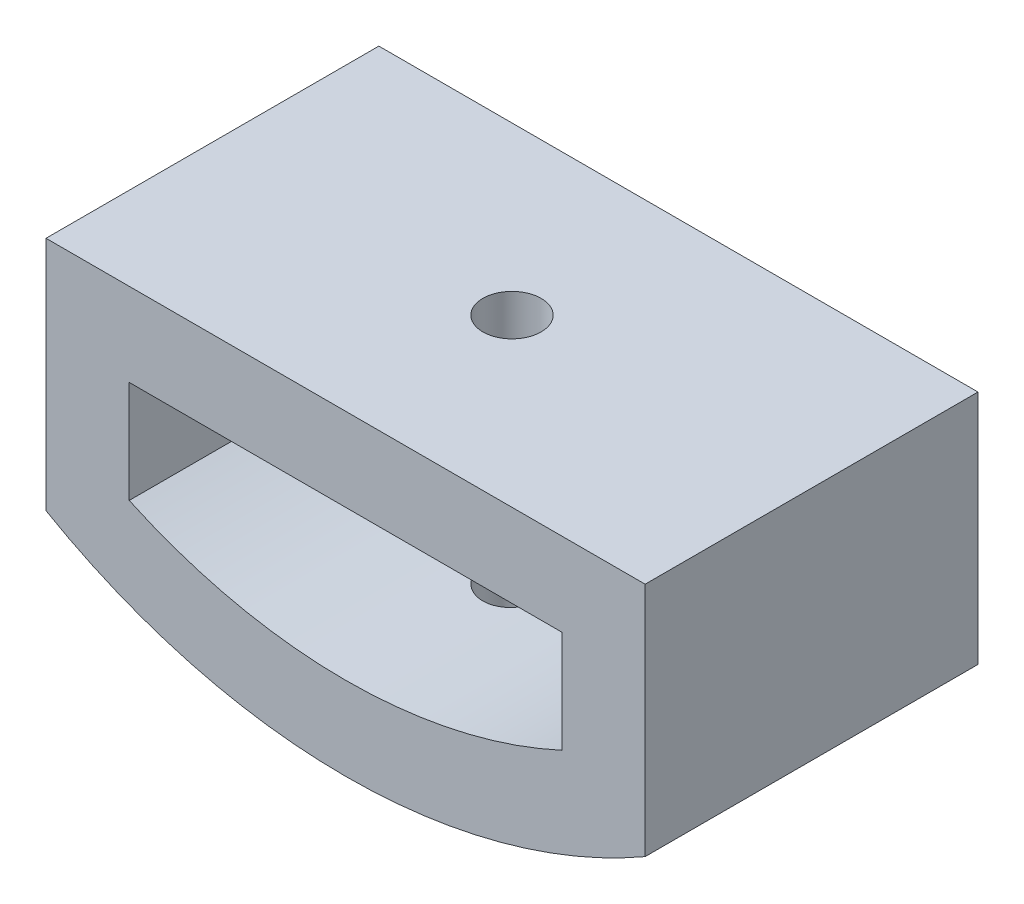
ISO-10303-21;
HEADER;
FILE_DESCRIPTION(('STEP AP214'),'2;1');
FILE_NAME('part.step','',(''),(''),'','','');
FILE_SCHEMA(('AUTOMOTIVE_DESIGN { 1 0 10303 214 1 1 1 1 }'));
ENDSEC;
DATA;
#1=APPLICATION_CONTEXT('core data for automotive mechanical design processes');
#2=APPLICATION_PROTOCOL_DEFINITION('international standard','automotive_design',2000,#1);
#3=PRODUCT_CONTEXT('',#1,'mechanical');
#4=PRODUCT('Part','Part','',(#3));
#5=PRODUCT_RELATED_PRODUCT_CATEGORY('part','',(#4));
#6=PRODUCT_DEFINITION_FORMATION('','',#4);
#7=PRODUCT_DEFINITION_CONTEXT('part definition',#1,'design');
#8=PRODUCT_DEFINITION('design','',#6,#7);
#9=PRODUCT_DEFINITION_SHAPE('','',#8);
#10=(LENGTH_UNIT() NAMED_UNIT(*) SI_UNIT(.MILLI.,.METRE.));
#11=(NAMED_UNIT(*) PLANE_ANGLE_UNIT() SI_UNIT($,.RADIAN.));
#12=(NAMED_UNIT(*) SI_UNIT($,.STERADIAN.) SOLID_ANGLE_UNIT());
#13=UNCERTAINTY_MEASURE_WITH_UNIT(LENGTH_MEASURE(1.E-05),#10,'distance_accuracy_value','');
#14=(GEOMETRIC_REPRESENTATION_CONTEXT(3) GLOBAL_UNCERTAINTY_ASSIGNED_CONTEXT((#13)) GLOBAL_UNIT_ASSIGNED_CONTEXT((#10,
#11,#12)) REPRESENTATION_CONTEXT('',''));
#15=CARTESIAN_POINT('',(0.,0.,0.));
#16=DIRECTION('',(0.,0.,1.));
#17=DIRECTION('',(1.,0.,0.));
#18=AXIS2_PLACEMENT_3D('',#15,#16,#17);
#19=CARTESIAN_POINT('',(0.,0.,10.));
#20=DIRECTION('',(0.,0.,-1.));
#21=DIRECTION('',(-1.,0.,0.));
#22=AXIS2_PLACEMENT_3D('',#19,#20,#21);
#23=CYLINDRICAL_SURFACE('',#22,15.5);
#24=CARTESIAN_POINT('',(0.,-15.5,5.875));
#25=CARTESIAN_POINT('',(0.0491071731834431,-15.4999996705944,5.87499783588226));
#26=CARTESIAN_POINT('',(0.09824895647254,-15.4997641299861,5.87085208723008));
#27=CARTESIAN_POINT('',(0.195176255878906,-15.4988471560204,5.85437301521202));
#28=CARTESIAN_POINT('',(0.242960115048824,-15.4981652004298,5.84203010224855));
#29=CARTESIAN_POINT('',(0.335753495446608,-15.4964325636527,5.80951177089862));
#30=CARTESIAN_POINT('',(0.380764440814087,-15.4953820736292,5.78934041264184));
#31=CARTESIAN_POINT('',(0.466749535573831,-15.4930306004436,5.74174418977581));
#32=CARTESIAN_POINT('',(0.507724620959285,-15.4917296755699,5.71432101246433));
#33=CARTESIAN_POINT('',(0.584538004698171,-15.4890218060226,5.65296182557492));
#34=CARTESIAN_POINT('',(0.620370618132307,-15.4876147465997,5.61901870373717));
#35=CARTESIAN_POINT('',(0.685833359404959,-15.4848541761742,5.54559761465866));
#36=CARTESIAN_POINT('',(0.71546323106227,-15.4835006673851,5.50611941892462));
#37=CARTESIAN_POINT('',(0.767696144330844,-15.4809989777071,5.42271763252899));
#38=CARTESIAN_POINT('',(0.790294583211297,-15.4798509315207,5.37879115487809));
#39=CARTESIAN_POINT('',(0.827793661333704,-15.4778910797385,5.2877599930964));
#40=CARTESIAN_POINT('',(0.842694370873767,-15.4770792710722,5.24065533799418));
#41=CARTESIAN_POINT('',(0.864359555364982,-15.4758845109363,5.14465868423292));
#42=CARTESIAN_POINT('',(0.871132768735348,-15.4755010988993,5.09576866354446));
#43=CARTESIAN_POINT('',(0.876377662953798,-15.4752049882841,4.99754420340506));
#44=CARTESIAN_POINT('',(0.874849423229832,-15.4752922852023,4.94820976821077));
#45=CARTESIAN_POINT('',(0.863542056230346,-15.4759273202646,4.85055636976696));
#46=CARTESIAN_POINT('',(0.853772377225552,-15.4764745311448,4.80223630858999));
#47=CARTESIAN_POINT('',(0.826274105440732,-15.4779668920098,4.70792308868196));
#48=CARTESIAN_POINT('',(0.808545472152446,-15.47891204402,4.66192994179538));
#49=CARTESIAN_POINT('',(0.765621783398995,-15.48109437473,4.57354572741357));
#50=CARTESIAN_POINT('',(0.740422430880505,-15.4823317214126,4.53115675109275));
#51=CARTESIAN_POINT('',(0.683275742305958,-15.4849588206083,4.45120701150883));
#52=CARTESIAN_POINT('',(0.651328344827962,-15.4863485745087,4.41364629219841));
#53=CARTESIAN_POINT('',(0.581539168419842,-15.48912620295,4.34436429584336));
#54=CARTESIAN_POINT('',(0.543689210117857,-15.4905140721459,4.31265125724773));
#55=CARTESIAN_POINT('',(0.463198043771124,-15.4931296460988,4.25602835305752));
#56=CARTESIAN_POINT('',(0.420556834322565,-15.4943573508088,4.23111848945624));
#57=CARTESIAN_POINT('',(0.33168868630968,-15.4965143161274,4.18880977904227));
#58=CARTESIAN_POINT('',(0.285461604861852,-15.4974435648362,4.17141123170881));
#59=CARTESIAN_POINT('',(0.190736113107066,-15.4988987312108,4.14462447727959));
#60=CARTESIAN_POINT('',(0.14223772445757,-15.4994246527216,4.13523619382044));
#61=CARTESIAN_POINT('',(0.0444178096076593,-15.5000134021482,4.12474664645022));
#62=CARTESIAN_POINT('',(-0.00490249123173848,-15.5000768667183,4.12363398962057));
#63=CARTESIAN_POINT('',(-0.103029064809225,-15.4997352420546,4.12969753032642));
#64=CARTESIAN_POINT('',(-0.151835339722116,-15.4993301548039,4.13687369277837));
#65=CARTESIAN_POINT('',(-0.24751642329515,-15.4980974508633,4.15930173575539));
#66=CARTESIAN_POINT('',(-0.294392458008775,-15.4972701070007,4.17454840202342));
#67=CARTESIAN_POINT('',(-0.384920227564263,-15.4952860037139,4.21267936507442));
#68=CARTESIAN_POINT('',(-0.428571938723266,-15.4941292418703,4.23556371794987));
#69=CARTESIAN_POINT('',(-0.511464193756999,-15.4916147717464,4.28834953917195));
#70=CARTESIAN_POINT('',(-0.55069987633316,-15.4902568457532,4.31825863093923));
#71=CARTESIAN_POINT('',(-0.62359740977994,-15.4874936517481,4.38423380306049));
#72=CARTESIAN_POINT('',(-0.657259215573696,-15.4860883833534,4.42029993320267));
#73=CARTESIAN_POINT('',(-0.718091933006208,-15.4833870598261,4.49761447817488));
#74=CARTESIAN_POINT('',(-0.745255463653431,-15.4820911299553,4.5388687054957));
#75=CARTESIAN_POINT('',(-0.792270092164751,-15.4797566050878,4.62535909754729));
#76=CARTESIAN_POINT('',(-0.812121228359953,-15.4787180087423,4.67059524140357));
#77=CARTESIAN_POINT('',(-0.843934739917809,-15.4770161713392,4.76373822183959));
#78=CARTESIAN_POINT('',(-0.855901791389932,-15.4763527078207,4.81164345704037));
#79=CARTESIAN_POINT('',(-0.871622715891765,-15.4754753331965,4.90878709408894));
#80=CARTESIAN_POINT('',(-0.875376652558362,-15.4752614186075,4.95802548560418));
#81=CARTESIAN_POINT('',(-0.874564185969052,-15.4753073493798,5.05636431234336));
#82=CARTESIAN_POINT('',(-0.870009390048366,-15.47556653382,5.10546484419769));
#83=CARTESIAN_POINT('',(-0.852732781730422,-15.4765280546384,5.20220284922323));
#84=CARTESIAN_POINT('',(-0.840010954117671,-15.4772303918423,5.24984031966852));
#85=CARTESIAN_POINT('',(-0.806763910415406,-15.4789989093103,5.34230201587434));
#86=CARTESIAN_POINT('',(-0.786238686650659,-15.4800650899322,5.38712623886776));
#87=CARTESIAN_POINT('',(-0.737969250321252,-15.4824411098091,5.47269360556119));
#88=CARTESIAN_POINT('',(-0.710225242369575,-15.4837509421576,5.51343686488883));
#89=CARTESIAN_POINT('',(-0.648263407453841,-15.4864687629549,5.58974425921163));
#90=CARTESIAN_POINT('',(-0.614037310019295,-15.4878768753334,5.6253016738811));
#91=CARTESIAN_POINT('',(-0.540091698196106,-15.4906315818375,5.6901777947369));
#92=CARTESIAN_POINT('',(-0.500370838072219,-15.491978160785,5.71949496813201));
#93=CARTESIAN_POINT('',(-0.416525226113139,-15.4944592208667,5.77107593345151));
#94=CARTESIAN_POINT('',(-0.372395705371244,-15.4955934684246,5.79333197621583));
#95=CARTESIAN_POINT('',(-0.281052471728243,-15.4975187583378,5.83009202550559));
#96=CARTESIAN_POINT('',(-0.233842460517063,-15.4983102041917,5.84460515061119));
#97=CARTESIAN_POINT('',(-0.155284423661831,-15.4992523199624,5.86167752144685));
#98=CARTESIAN_POINT('',(-0.124444733863215,-15.4995314610104,5.86666703272838));
#99=CARTESIAN_POINT('',(-0.062408022674479,-15.4999054056072,5.87332895789179));
#100=CARTESIAN_POINT('',(-0.0312110016800361,-15.50000020936,5.87500137544636));
#101=CARTESIAN_POINT('',(0.,-15.5,5.875));
#102=B_SPLINE_CURVE_WITH_KNOTS('',3,(#24,#25,#26,#27,#28,#29,#30,#31,#32,#33,#34,#35,#36,#37,
#38,#39,#40,#41,#42,#43,#44,#45,#46,#47,#48,#49,#50,#51,#52,#53,#54,#55,#56,#57,#58,#59,#60,#61,
#62,#63,#64,#65,#66,#67,#68,#69,#70,#71,#72,#73,#74,#75,#76,#77,#78,#79,#80,#81,#82,#83,#84,#85,
#86,#87,#88,#89,#90,#91,#92,#93,#94,#95,#96,#97,#98,#99,#100,#101),.UNSPECIFIED.,.T.,.F.,(4,2,2,
2,2,2,2,2,2,2,2,2,2,2,2,2,2,2,2,2,2,2,2,2,2,2,2,2,2,2,2,2,2,2,2,2,2,2,4),(0.,0.147207584406241,
0.2945876862831,0.441891453157804,0.589160976629402,0.736592070381813,0.88402925202701,
1.03156274304558,1.17909488671762,1.32646826609707,1.4738402354168,1.62104348166905,
1.76824747714221,1.915536307114,2.06282647779344,2.21032259729529,2.35781876001285,
2.50532080291927,2.65282143964427,2.80011897702594,2.94741589095309,3.09461775403723,
3.24182069822089,3.38918413489114,3.5365487632557,3.68407998766663,3.83161043871729,
3.97905330939336,4.12649503764796,4.27373094689464,4.42096713044826,4.56820345882021,
4.71543561430341,4.86285690388399,5.01031436289276,5.15793309214934,5.30537758976411,
5.39893828473857,5.49249887612211),.UNSPECIFIED.);
#103=CARTESIAN_POINT('',(0.,-15.5,5.875));
#104=VERTEX_POINT('',#103);
#105=EDGE_CURVE('E141',#104,#104,#102,.T.);
#106=ORIENTED_EDGE('',*,*,#105,.F.);
#107=EDGE_LOOP('',(#106));
#108=FACE_BOUND('',#107,.T.);
#109=CARTESIAN_POINT('',(0.,0.,0.));
#110=DIRECTION('',(0.,0.,1.));
#111=DIRECTION('',(1.,0.,0.));
#112=AXIS2_PLACEMENT_3D('',#109,#110,#111);
#113=CIRCLE('',#112,15.5);
#114=CARTESIAN_POINT('',(-6.5,-14.0712472794703,0.));
#115=VERTEX_POINT('',#114);
#116=CARTESIAN_POINT('',(6.5,-14.0712472794703,0.));
#117=VERTEX_POINT('',#116);
#118=EDGE_CURVE('E148',#115,#117,#113,.T.);
#119=ORIENTED_EDGE('',*,*,#118,.F.);
#120=DIRECTION('',(0.,0.,-1.));
#121=VECTOR('',#120,1.);
#122=CARTESIAN_POINT('',(-6.5,-14.0712472794703,10.));
#123=LINE('',#122,#121);
#124=CARTESIAN_POINT('',(-6.5,-14.0712472794703,10.));
#125=VERTEX_POINT('',#124);
#126=EDGE_CURVE('E11',#125,#115,#123,.T.);
#127=ORIENTED_EDGE('',*,*,#126,.F.);
#128=CARTESIAN_POINT('',(0.,0.,10.));
#129=DIRECTION('',(0.,0.,1.));
#130=DIRECTION('',(1.,0.,0.));
#131=AXIS2_PLACEMENT_3D('',#128,#129,#130);
#132=CIRCLE('',#131,15.5);
#133=CARTESIAN_POINT('',(6.5,-14.0712472794703,10.));
#134=VERTEX_POINT('',#133);
#135=EDGE_CURVE('E129',#125,#134,#132,.T.);
#136=ORIENTED_EDGE('',*,*,#135,.T.);
#137=DIRECTION('',(0.,0.,-1.));
#138=VECTOR('',#137,1.);
#139=CARTESIAN_POINT('',(6.5,-14.0712472794703,10.));
#140=LINE('',#139,#138);
#141=EDGE_CURVE('E93',#134,#117,#140,.T.);
#142=ORIENTED_EDGE('',*,*,#141,.T.);
#143=EDGE_LOOP('',(#119,#127,#136,#142));
#144=FACE_BOUND('',#143,.T.);
#145=ADVANCED_FACE('F35',(#108,#144),#23,.F.);
#146=CARTESIAN_POINT('',(-6.5,0.,10.));
#147=DIRECTION('',(1.,0.,0.));
#148=DIRECTION('',(0.,0.,-1.));
#149=AXIS2_PLACEMENT_3D('',#146,#147,#148);
#150=PLANE('',#149);
#151=DIRECTION('',(0.,-1.,0.));
#152=VECTOR('',#151,1.);
#153=CARTESIAN_POINT('',(-6.5,0.,0.));
#154=LINE('',#153,#152);
#155=CARTESIAN_POINT('',(-6.5,-11.,0.));
#156=VERTEX_POINT('',#155);
#157=EDGE_CURVE('E121',#156,#115,#154,.T.);
#158=ORIENTED_EDGE('',*,*,#157,.F.);
#159=DIRECTION('',(0.,0.,-1.));
#160=VECTOR('',#159,1.);
#161=CARTESIAN_POINT('',(-6.5,-11.,10.));
#162=LINE('',#161,#160);
#163=CARTESIAN_POINT('',(-6.5,-11.,10.));
#164=VERTEX_POINT('',#163);
#165=EDGE_CURVE('E50',#164,#156,#162,.T.);
#166=ORIENTED_EDGE('',*,*,#165,.F.);
#167=DIRECTION('',(0.,-1.,0.));
#168=VECTOR('',#167,1.);
#169=CARTESIAN_POINT('',(-6.5,0.,10.));
#170=LINE('',#169,#168);
#171=EDGE_CURVE('E119',#164,#125,#170,.T.);
#172=ORIENTED_EDGE('',*,*,#171,.T.);
#173=ORIENTED_EDGE('',*,*,#126,.T.);
#174=EDGE_LOOP('',(#158,#166,#172,#173));
#175=FACE_BOUND('',#174,.T.);
#176=ADVANCED_FACE('F118',(#175),#150,.T.);
#177=CARTESIAN_POINT('',(0.,-11.,10.));
#178=DIRECTION('',(0.,-1.,0.));
#179=DIRECTION('',(1.,0.,0.));
#180=AXIS2_PLACEMENT_3D('',#177,#178,#179);
#181=PLANE('',#180);
#182=CARTESIAN_POINT('',(0.,-11.,5.));
#183=DIRECTION('',(0.,-1.,0.));
#184=DIRECTION('',(1.,0.,0.));
#185=AXIS2_PLACEMENT_3D('',#182,#183,#184);
#186=CIRCLE('',#185,0.875);
#187=CARTESIAN_POINT('',(0.875,-11.,5.));
#188=VERTEX_POINT('',#187);
#189=EDGE_CURVE('E219',#188,#188,#186,.T.);
#190=ORIENTED_EDGE('',*,*,#189,.F.);
#191=EDGE_LOOP('',(#190));
#192=FACE_BOUND('',#191,.T.);
#193=DIRECTION('',(-1.,0.,0.));
#194=VECTOR('',#193,1.);
#195=CARTESIAN_POINT('',(0.,-11.,0.));
#196=LINE('',#195,#194);
#197=CARTESIAN_POINT('',(6.5,-11.,0.));
#198=VERTEX_POINT('',#197);
#199=EDGE_CURVE('E152',#198,#156,#196,.T.);
#200=ORIENTED_EDGE('',*,*,#199,.F.);
#201=DIRECTION('',(0.,0.,-1.));
#202=VECTOR('',#201,1.);
#203=CARTESIAN_POINT('',(6.5,-11.,10.));
#204=LINE('',#203,#202);
#205=CARTESIAN_POINT('',(6.5,-11.,10.));
#206=VERTEX_POINT('',#205);
#207=EDGE_CURVE('E86',#206,#198,#204,.T.);
#208=ORIENTED_EDGE('',*,*,#207,.F.);
#209=DIRECTION('',(-1.,0.,0.));
#210=VECTOR('',#209,1.);
#211=CARTESIAN_POINT('',(0.,-11.,10.));
#212=LINE('',#211,#210);
#213=EDGE_CURVE('E128',#206,#164,#212,.T.);
#214=ORIENTED_EDGE('',*,*,#213,.T.);
#215=ORIENTED_EDGE('',*,*,#165,.T.);
#216=EDGE_LOOP('',(#200,#208,#214,#215));
#217=FACE_BOUND('',#216,.T.);
#218=ADVANCED_FACE('F131',(#192,#217),#181,.T.);
#219=CARTESIAN_POINT('',(9.,0.,10.));
#220=DIRECTION('',(1.,0.,0.));
#221=DIRECTION('',(0.,0.,-1.));
#222=AXIS2_PLACEMENT_3D('',#219,#220,#221);
#223=PLANE('',#222);
#224=DIRECTION('',(0.,-1.,0.));
#225=VECTOR('',#224,1.);
#226=CARTESIAN_POINT('',(9.,0.,0.));
#227=LINE('',#226,#225);
#228=CARTESIAN_POINT('',(9.,-8.5,0.));
#229=VERTEX_POINT('',#228);
#230=CARTESIAN_POINT('',(9.,-15.5884572681199,0.));
#231=VERTEX_POINT('',#230);
#232=EDGE_CURVE('E137',#229,#231,#227,.T.);
#233=ORIENTED_EDGE('',*,*,#232,.F.);
#234=DIRECTION('',(0.,0.,-1.));
#235=VECTOR('',#234,1.);
#236=CARTESIAN_POINT('',(9.,-8.5,10.));
#237=LINE('',#236,#235);
#238=CARTESIAN_POINT('',(9.,-8.5,10.));
#239=VERTEX_POINT('',#238);
#240=EDGE_CURVE('E100',#239,#229,#237,.T.);
#241=ORIENTED_EDGE('',*,*,#240,.F.);
#242=DIRECTION('',(0.,-1.,0.));
#243=VECTOR('',#242,1.);
#244=CARTESIAN_POINT('',(9.,0.,10.));
#245=LINE('',#244,#243);
#246=CARTESIAN_POINT('',(9.,-15.5884572681199,10.));
#247=VERTEX_POINT('',#246);
#248=EDGE_CURVE('E156',#239,#247,#245,.T.);
#249=ORIENTED_EDGE('',*,*,#248,.T.);
#250=DIRECTION('',(0.,0.,-1.));
#251=VECTOR('',#250,1.);
#252=CARTESIAN_POINT('',(9.,-15.5884572681199,10.));
#253=LINE('',#252,#251);
#254=EDGE_CURVE('E133',#247,#231,#253,.T.);
#255=ORIENTED_EDGE('',*,*,#254,.T.);
#256=EDGE_LOOP('',(#233,#241,#249,#255));
#257=FACE_BOUND('',#256,.T.);
#258=ADVANCED_FACE('F37',(#257),#223,.T.);
#259=CARTESIAN_POINT('',(0.,-8.5,10.));
#260=DIRECTION('',(0.,-1.,0.));
#261=DIRECTION('',(1.,0.,0.));
#262=AXIS2_PLACEMENT_3D('',#259,#260,#261);
#263=PLANE('',#262);
#264=CARTESIAN_POINT('',(0.,-8.5,5.));
#265=DIRECTION('',(0.,-1.,0.));
#266=DIRECTION('',(1.,0.,0.));
#267=AXIS2_PLACEMENT_3D('',#264,#265,#266);
#268=CIRCLE('',#267,0.875);
#269=CARTESIAN_POINT('',(0.875,-8.5,5.));
#270=VERTEX_POINT('',#269);
#271=EDGE_CURVE('E322',#270,#270,#268,.T.);
#272=ORIENTED_EDGE('',*,*,#271,.T.);
#273=EDGE_LOOP('',(#272));
#274=FACE_BOUND('',#273,.T.);
#275=DIRECTION('',(-1.,0.,0.));
#276=VECTOR('',#275,1.);
#277=CARTESIAN_POINT('',(0.,-8.5,0.));
#278=LINE('',#277,#276);
#279=CARTESIAN_POINT('',(-9.,-8.5,0.));
#280=VERTEX_POINT('',#279);
#281=EDGE_CURVE('E140',#229,#280,#278,.T.);
#282=ORIENTED_EDGE('',*,*,#281,.T.);
#283=DIRECTION('',(0.,0.,-1.));
#284=VECTOR('',#283,1.);
#285=CARTESIAN_POINT('',(-9.,-8.5,10.));
#286=LINE('',#285,#284);
#287=CARTESIAN_POINT('',(-9.,-8.5,10.));
#288=VERTEX_POINT('',#287);
#289=EDGE_CURVE('E163',#288,#280,#286,.T.);
#290=ORIENTED_EDGE('',*,*,#289,.F.);
#291=DIRECTION('',(-1.,0.,0.));
#292=VECTOR('',#291,1.);
#293=CARTESIAN_POINT('',(0.,-8.5,10.));
#294=LINE('',#293,#292);
#295=EDGE_CURVE('E169',#239,#288,#294,.T.);
#296=ORIENTED_EDGE('',*,*,#295,.F.);
#297=ORIENTED_EDGE('',*,*,#240,.T.);
#298=EDGE_LOOP('',(#282,#290,#296,#297));
#299=FACE_BOUND('',#298,.T.);
#300=ADVANCED_FACE('F167',(#274,#299),#263,.F.);
#301=CARTESIAN_POINT('',(-9.,0.,10.));
#302=DIRECTION('',(1.,0.,0.));
#303=DIRECTION('',(0.,0.,-1.));
#304=AXIS2_PLACEMENT_3D('',#301,#302,#303);
#305=PLANE('',#304);
#306=DIRECTION('',(0.,-1.,0.));
#307=VECTOR('',#306,1.);
#308=CARTESIAN_POINT('',(-9.,0.,0.));
#309=LINE('',#308,#307);
#310=CARTESIAN_POINT('',(-9.,-15.5884572681199,0.));
#311=VERTEX_POINT('',#310);
#312=EDGE_CURVE('E143',#280,#311,#309,.T.);
#313=ORIENTED_EDGE('',*,*,#312,.T.);
#314=DIRECTION('',(0.,0.,-1.));
#315=VECTOR('',#314,1.);
#316=CARTESIAN_POINT('',(-9.,-15.5884572681199,10.));
#317=LINE('',#316,#315);
#318=CARTESIAN_POINT('',(-9.,-15.5884572681199,10.));
#319=VERTEX_POINT('',#318);
#320=EDGE_CURVE('E160',#319,#311,#317,.T.);
#321=ORIENTED_EDGE('',*,*,#320,.F.);
#322=DIRECTION('',(0.,-1.,0.));
#323=VECTOR('',#322,1.);
#324=CARTESIAN_POINT('',(-9.,0.,10.));
#325=LINE('',#324,#323);
#326=EDGE_CURVE('E185',#288,#319,#325,.T.);
#327=ORIENTED_EDGE('',*,*,#326,.F.);
#328=ORIENTED_EDGE('',*,*,#289,.T.);
#329=EDGE_LOOP('',(#313,#321,#327,#328));
#330=FACE_BOUND('',#329,.T.);
#331=ADVANCED_FACE('F184',(#330),#305,.F.);
#332=CARTESIAN_POINT('',(0.,0.,10.));
#333=DIRECTION('',(0.,0.,-1.));
#334=DIRECTION('',(-1.,0.,0.));
#335=AXIS2_PLACEMENT_3D('',#332,#333,#334);
#336=CYLINDRICAL_SURFACE('',#335,18.);
#337=CARTESIAN_POINT('',(0.,-18.,5.875));
#338=CARTESIAN_POINT('',(0.0491180095956558,-17.9999997152942,5.87499783166739));
#339=CARTESIAN_POINT('',(0.0982708950720977,-17.999796798227,5.87085026052735));
#340=CARTESIAN_POINT('',(0.195220835816494,-17.9990068293972,5.85436352719689));
#341=CARTESIAN_POINT('',(0.243016222279541,-17.9984193245118,5.84201470200926));
#342=CARTESIAN_POINT('',(0.335832713232275,-17.9969266789661,5.80947974592409));
#343=CARTESIAN_POINT('',(0.380855213303428,-17.9960216996506,5.7892975954766));
#344=CARTESIAN_POINT('',(0.466861136310453,-17.9939960412367,5.74167496813619));
#345=CARTESIAN_POINT('',(0.507845512347921,-17.9928754132222,5.7142362096502));
#346=CARTESIAN_POINT('',(0.584663485351439,-17.9905433250728,5.65284977573124));
#347=CARTESIAN_POINT('',(0.62049272083426,-17.989331789329,5.61889664485102));
#348=CARTESIAN_POINT('',(0.685946205914012,-17.9869550859705,5.54545610697489));
#349=CARTESIAN_POINT('',(0.715570202592372,-17.9857899202473,5.50596847450834));
#350=CARTESIAN_POINT('',(0.767784106589646,-17.9836368196398,5.42255723539334));
#351=CARTESIAN_POINT('',(0.790370640318365,-17.9826489698524,5.37863151455236));
#352=CARTESIAN_POINT('',(0.827846816196876,-17.9809628101987,5.28760587814624));
#353=CARTESIAN_POINT('',(0.842736514390944,-17.9802644982243,5.24050598569657));
#354=CARTESIAN_POINT('',(0.864384919998992,-17.9792368387841,5.14450883193065));
#355=CARTESIAN_POINT('',(0.871150106447426,-17.9789071973299,5.09561303490484));
#356=CARTESIAN_POINT('',(0.87637743839923,-17.9786531688018,4.99737879270733));
#357=CARTESIAN_POINT('',(0.874839646652075,-17.9787287786652,4.94804035088371));
#358=CARTESIAN_POINT('',(0.863510075008365,-17.9792764530831,4.85036538606512));
#359=CARTESIAN_POINT('',(0.853725294913418,-17.9797481814226,4.80202804899875));
#360=CARTESIAN_POINT('',(0.826190346770653,-17.9810343940476,4.70768281505656));
#361=CARTESIAN_POINT('',(0.808440146439372,-17.9818488797224,4.66167492762271));
#362=CARTESIAN_POINT('',(0.76547022280148,-17.9837291935924,4.57327203496776));
#363=CARTESIAN_POINT('',(0.740247306698212,-17.9847951291826,4.53087858404346));
#364=CARTESIAN_POINT('',(0.683050265826435,-17.9870580899992,4.45092496141257));
#365=CARTESIAN_POINT('',(0.651076096167942,-17.9882551160973,4.41336482184598));
#366=CARTESIAN_POINT('',(0.581244668698129,-17.9906468339027,4.34410327311938));
#367=CARTESIAN_POINT('',(0.543381348792343,-17.9918415219057,4.31240797548166));
#368=CARTESIAN_POINT('',(0.462867732395442,-17.9940927134006,4.25582291372961));
#369=CARTESIAN_POINT('',(0.420217434767941,-17.9951492168598,4.23093315123084));
#370=CARTESIAN_POINT('',(0.331336987534438,-17.9970050108353,4.18866628235621));
#371=CARTESIAN_POINT('',(0.285106737202494,-17.9978042941112,4.17128938745383));
#372=CARTESIAN_POINT('',(0.190380272178829,-17.9990554592647,4.1445455066524));
#373=CARTESIAN_POINT('',(0.141884073528511,-17.9995073436012,4.13517846405801));
#374=CARTESIAN_POINT('',(0.0440554011241092,-18.0000124659109,4.12472771253176));
#375=CARTESIAN_POINT('',(-0.0052761675448817,-18.0000661107259,4.12363554995088));
#376=CARTESIAN_POINT('',(-0.103421878189429,-17.9997697879955,4.12974350237512));
#377=CARTESIAN_POINT('',(-0.152236021780428,-17.9994198217106,4.13694359148348));
#378=CARTESIAN_POINT('',(-0.247937550244791,-17.9983559583496,4.15942466639141));
#379=CARTESIAN_POINT('',(-0.294825843510539,-17.9976422350323,4.17470179409339));
#380=CARTESIAN_POINT('',(-0.38537266028174,-17.9959312190721,4.21289937328513));
#381=CARTESIAN_POINT('',(-0.429031166221702,-17.9949339248871,4.2358198663403));
#382=CARTESIAN_POINT('',(-0.511917928511803,-17.9927669575882,4.28867520221881));
#383=CARTESIAN_POINT('',(-0.551142566307898,-17.9915971454482,4.31861571380922));
#384=CARTESIAN_POINT('',(-0.624011768974596,-17.9892173574211,4.3846528998709));
#385=CARTESIAN_POINT('',(-0.657656299897862,-17.9880073812897,4.42074961179155));
#386=CARTESIAN_POINT('',(-0.718438686039828,-17.9856824849874,4.49811090075844));
#387=CARTESIAN_POINT('',(-0.745571073065553,-17.9845676452044,4.53937977687954));
#388=CARTESIAN_POINT('',(-0.792521610605676,-17.9825599979538,4.62589218571113));
#389=CARTESIAN_POINT('',(-0.812339791648177,-17.9816671895595,4.67113570183126));
#390=CARTESIAN_POINT('',(-0.844089811943677,-17.9802048552436,4.76429280683077));
#391=CARTESIAN_POINT('',(-0.856025141547691,-17.9796351862588,4.81220520378541));
#392=CARTESIAN_POINT('',(-0.871682076324854,-17.9788829669299,4.90935670738427));
#393=CARTESIAN_POINT('',(-0.875403724745625,-17.9787004145475,4.9585958070416));
#394=CARTESIAN_POINT('',(-0.874527238279024,-17.9787430655558,5.05694855497639));
#395=CARTESIAN_POINT('',(-0.869937706692955,-17.9789678472955,5.10606228033943));
#396=CARTESIAN_POINT('',(-0.852586918252041,-17.9797989407871,5.20282105760247));
#397=CARTESIAN_POINT('',(-0.839825645759218,-17.9804052532691,5.25046610669172));
#398=CARTESIAN_POINT('',(-0.806495354137135,-17.9819309773663,5.34293693113419));
#399=CARTESIAN_POINT('',(-0.785926269123951,-17.9828503916235,5.38776268269387));
#400=CARTESIAN_POINT('',(-0.737565767809009,-17.9848986624609,5.47332500935897));
#401=CARTESIAN_POINT('',(-0.709774576482075,-17.9860275125167,5.514061711787));
#402=CARTESIAN_POINT('',(-0.647728120395682,-17.9883687495997,5.59033243445651));
#403=CARTESIAN_POINT('',(-0.613466895145142,-17.9895812129963,5.62586160324461));
#404=CARTESIAN_POINT('',(-0.539456148158159,-17.9919525016027,5.69067493486511));
#405=CARTESIAN_POINT('',(-0.499705277578998,-17.9931113135363,5.71995755836587));
#406=CARTESIAN_POINT('',(-0.415813773146466,-17.9952454823377,5.77145951000274));
#407=CARTESIAN_POINT('',(-0.371669085495654,-17.996220667345,5.79367223454998));
#408=CARTESIAN_POINT('',(-0.280305267529994,-17.9978750910422,5.83034422244325));
#409=CARTESIAN_POINT('',(-0.233089846090084,-17.9985546793983,5.84481265134217));
#410=CARTESIAN_POINT('',(-0.154650539909572,-17.9993614230095,5.86178688112537));
#411=CARTESIAN_POINT('',(-0.123934815529115,-17.9995998381299,5.86673548263056));
#412=CARTESIAN_POINT('',(-0.0621507159001524,-17.9999192166441,5.87334272681657));
#413=CARTESIAN_POINT('',(-0.0310823409350771,-18.0000001801645,5.87500137214138));
#414=CARTESIAN_POINT('',(0.,-18.,5.875));
#415=B_SPLINE_CURVE_WITH_KNOTS('',3,(#337,#338,#339,#340,#341,#342,#343,#344,#345,#346,#347,
#348,#349,#350,#351,#352,#353,#354,#355,#356,#357,#358,#359,#360,#361,#362,#363,#364,#365,#366,
#367,#368,#369,#370,#371,#372,#373,#374,#375,#376,#377,#378,#379,#380,#381,#382,#383,#384,#385,
#386,#387,#388,#389,#390,#391,#392,#393,#394,#395,#396,#397,#398,#399,#400,#401,#402,#403,#404,
#405,#406,#407,#408,#409,#410,#411,#412,#413,#414),.UNSPECIFIED.,.T.,.F.,(4,2,2,2,2,2,2,2,2,2,2,
2,2,2,2,2,2,2,2,2,2,2,2,2,2,2,2,2,2,2,2,2,2,2,2,2,2,2,4),(0.,0.147240567300661,
0.294654926967554,0.441994476909956,0.589299167184537,0.736727760191773,0.884162361054242,
1.03166753015846,1.17917162519312,1.32655801222137,1.47394328538358,1.62120358808278,
1.76846448762622,1.91578839690449,2.0631132857899,2.2105908420842,2.35806843338844,
2.50555017564708,2.65303087399154,2.80036088514969,2.94769043619641,3.09494967695253,
3.24220971853258,3.38958908679684,3.53696935163057,3.68447294084962,3.83197591440979,
3.97941353307606,4.12685037543491,4.27413468607305,4.42141927856494,4.56870511390206,
4.71598636170855,4.86340395955174,5.01085784354743,5.15844905433887,5.30586519910425,
5.39904049728895,5.49221572059275),.UNSPECIFIED.);
#416=CARTESIAN_POINT('',(0.,-18.,5.875));
#417=VERTEX_POINT('',#416);
#418=EDGE_CURVE('E39',#417,#417,#415,.T.);
#419=ORIENTED_EDGE('',*,*,#418,.T.);
#420=EDGE_LOOP('',(#419));
#421=FACE_BOUND('',#420,.T.);
#422=CARTESIAN_POINT('',(0.,0.,0.));
#423=DIRECTION('',(0.,0.,1.));
#424=DIRECTION('',(1.,0.,0.));
#425=AXIS2_PLACEMENT_3D('',#422,#423,#424);
#426=CIRCLE('',#425,18.);
#427=EDGE_CURVE('E145',#311,#231,#426,.T.);
#428=ORIENTED_EDGE('',*,*,#427,.T.);
#429=ORIENTED_EDGE('',*,*,#254,.F.);
#430=CARTESIAN_POINT('',(0.,0.,10.));
#431=DIRECTION('',(0.,0.,1.));
#432=DIRECTION('',(1.,0.,0.));
#433=AXIS2_PLACEMENT_3D('',#430,#431,#432);
#434=CIRCLE('',#433,18.);
#435=EDGE_CURVE('E181',#319,#247,#434,.T.);
#436=ORIENTED_EDGE('',*,*,#435,.F.);
#437=ORIENTED_EDGE('',*,*,#320,.T.);
#438=EDGE_LOOP('',(#428,#429,#436,#437));
#439=FACE_BOUND('',#438,.T.);
#440=ADVANCED_FACE('F179',(#421,#439),#336,.T.);
#441=CARTESIAN_POINT('',(6.5,0.,10.));
#442=DIRECTION('',(1.,0.,0.));
#443=DIRECTION('',(0.,0.,-1.));
#444=AXIS2_PLACEMENT_3D('',#441,#442,#443);
#445=PLANE('',#444);
#446=DIRECTION('',(0.,-1.,0.));
#447=VECTOR('',#446,1.);
#448=CARTESIAN_POINT('',(6.5,0.,0.));
#449=LINE('',#448,#447);
#450=EDGE_CURVE('E154',#198,#117,#449,.T.);
#451=ORIENTED_EDGE('',*,*,#450,.T.);
#452=ORIENTED_EDGE('',*,*,#141,.F.);
#453=DIRECTION('',(0.,-1.,0.));
#454=VECTOR('',#453,1.);
#455=CARTESIAN_POINT('',(6.5,0.,10.));
#456=LINE('',#455,#454);
#457=EDGE_CURVE('E59',#206,#134,#456,.T.);
#458=ORIENTED_EDGE('',*,*,#457,.F.);
#459=ORIENTED_EDGE('',*,*,#207,.T.);
#460=EDGE_LOOP('',(#451,#452,#458,#459));
#461=FACE_BOUND('',#460,.T.);
#462=ADVANCED_FACE('F191',(#461),#445,.F.);
#463=CARTESIAN_POINT('',(0.,0.,10.));
#464=DIRECTION('',(0.,0.,1.));
#465=DIRECTION('',(1.,0.,0.));
#466=AXIS2_PLACEMENT_3D('',#463,#464,#465);
#467=PLANE('',#466);
#468=ORIENTED_EDGE('',*,*,#248,.F.);
#469=ORIENTED_EDGE('',*,*,#295,.T.);
#470=ORIENTED_EDGE('',*,*,#326,.T.);
#471=ORIENTED_EDGE('',*,*,#435,.T.);
#472=EDGE_LOOP('',(#468,#469,#470,#471));
#473=FACE_BOUND('',#472,.T.);
#474=ORIENTED_EDGE('',*,*,#135,.F.);
#475=ORIENTED_EDGE('',*,*,#171,.F.);
#476=ORIENTED_EDGE('',*,*,#213,.F.);
#477=ORIENTED_EDGE('',*,*,#457,.T.);
#478=EDGE_LOOP('',(#474,#475,#476,#477));
#479=FACE_BOUND('',#478,.T.);
#480=ADVANCED_FACE('F127',(#473,#479),#467,.T.);
#481=CARTESIAN_POINT('',(0.,0.,0.));
#482=DIRECTION('',(0.,0.,1.));
#483=DIRECTION('',(1.,0.,0.));
#484=AXIS2_PLACEMENT_3D('',#481,#482,#483);
#485=PLANE('',#484);
#486=ORIENTED_EDGE('',*,*,#232,.T.);
#487=ORIENTED_EDGE('',*,*,#427,.F.);
#488=ORIENTED_EDGE('',*,*,#312,.F.);
#489=ORIENTED_EDGE('',*,*,#281,.F.);
#490=EDGE_LOOP('',(#486,#487,#488,#489));
#491=FACE_BOUND('',#490,.T.);
#492=ORIENTED_EDGE('',*,*,#118,.T.);
#493=ORIENTED_EDGE('',*,*,#450,.F.);
#494=ORIENTED_EDGE('',*,*,#199,.T.);
#495=ORIENTED_EDGE('',*,*,#157,.T.);
#496=EDGE_LOOP('',(#492,#493,#494,#495));
#497=FACE_BOUND('',#496,.T.);
#498=ADVANCED_FACE('F173',(#491,#497),#485,.F.);
#499=CARTESIAN_POINT('',(0.,-23.,5.));
#500=DIRECTION('',(0.,1.,0.));
#501=DIRECTION('',(0.,0.,1.));
#502=AXIS2_PLACEMENT_3D('',#499,#500,#501);
#503=CYLINDRICAL_SURFACE('',#502,0.875);
#504=ORIENTED_EDGE('',*,*,#105,.T.);
#505=EDGE_LOOP('',(#504));
#506=FACE_BOUND('',#505,.T.);
#507=ORIENTED_EDGE('',*,*,#418,.F.);
#508=EDGE_LOOP('',(#507));
#509=FACE_BOUND('',#508,.T.);
#510=ADVANCED_FACE('F221',(#506,#509),#503,.F.);
#511=ORIENTED_EDGE('',*,*,#189,.T.);
#512=EDGE_LOOP('',(#511));
#513=FACE_BOUND('',#512,.T.);
#514=ORIENTED_EDGE('',*,*,#271,.F.);
#515=EDGE_LOOP('',(#514));
#516=FACE_BOUND('',#515,.T.);
#517=ADVANCED_FACE('F224',(#513,#516),#503,.F.);
#518=CLOSED_SHELL('',(#145,#176,#218,#258,#300,#331,#440,#462,#480,#498,#510,#517));
#519=MANIFOLD_SOLID_BREP('B2',#518);
#520=ADVANCED_BREP_SHAPE_REPRESENTATION('',(#18,#519),#14);
#521=SHAPE_DEFINITION_REPRESENTATION(#9,#520);
ENDSEC;
END-ISO-10303-21;
